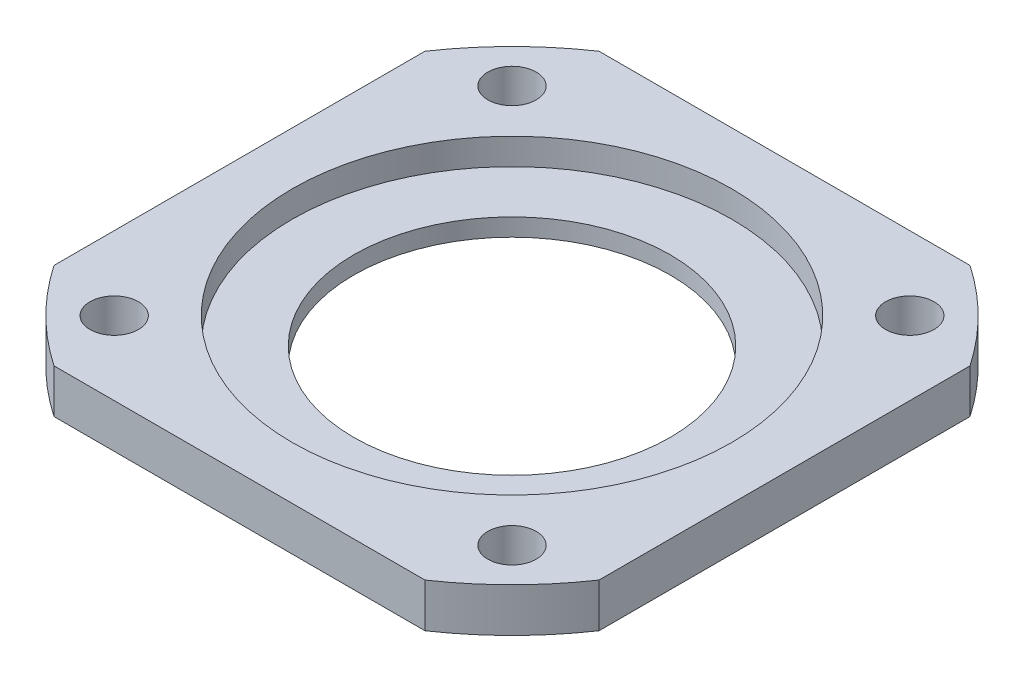
ISO-10303-21;
HEADER;
FILE_DESCRIPTION(('STEP AP214'),'2;1');
FILE_NAME('part.step','',(''),(''),'','','');
FILE_SCHEMA(('AUTOMOTIVE_DESIGN { 1 0 10303 214 1 1 1 1 }'));
ENDSEC;
DATA;
#1=APPLICATION_CONTEXT('core data for automotive mechanical design processes');
#2=APPLICATION_PROTOCOL_DEFINITION('international standard','automotive_design',2000,#1);
#3=PRODUCT_CONTEXT('',#1,'mechanical');
#4=PRODUCT('Part','Part','',(#3));
#5=PRODUCT_RELATED_PRODUCT_CATEGORY('part','',(#4));
#6=PRODUCT_DEFINITION_FORMATION('','',#4);
#7=PRODUCT_DEFINITION_CONTEXT('part definition',#1,'design');
#8=PRODUCT_DEFINITION('design','',#6,#7);
#9=PRODUCT_DEFINITION_SHAPE('','',#8);
#10=(LENGTH_UNIT() NAMED_UNIT(*) SI_UNIT(.MILLI.,.METRE.));
#11=(NAMED_UNIT(*) PLANE_ANGLE_UNIT() SI_UNIT($,.RADIAN.));
#12=(NAMED_UNIT(*) SI_UNIT($,.STERADIAN.) SOLID_ANGLE_UNIT());
#13=UNCERTAINTY_MEASURE_WITH_UNIT(LENGTH_MEASURE(1.E-05),#10,'distance_accuracy_value','');
#14=(GEOMETRIC_REPRESENTATION_CONTEXT(3) GLOBAL_UNCERTAINTY_ASSIGNED_CONTEXT((#13)) GLOBAL_UNIT_ASSIGNED_CONTEXT((#10,
#11,#12)) REPRESENTATION_CONTEXT('',''));
#15=CARTESIAN_POINT('',(0.,0.,0.));
#16=DIRECTION('',(0.,0.,1.));
#17=DIRECTION('',(1.,0.,0.));
#18=AXIS2_PLACEMENT_3D('',#15,#16,#17);
#19=CARTESIAN_POINT('',(0.,5.,0.));
#20=DIRECTION('',(0.,1.,0.));
#21=DIRECTION('',(0.,0.,1.));
#22=AXIS2_PLACEMENT_3D('',#19,#20,#21);
#23=PLANE('',#22);
#24=CARTESIAN_POINT('',(-22.6274169979695,5.,22.6274169979695));
#25=DIRECTION('',(0.,1.,0.));
#26=DIRECTION('',(0.,0.,1.));
#27=AXIS2_PLACEMENT_3D('',#24,#25,#26);
#28=CIRCLE('',#27,2.75);
#29=CARTESIAN_POINT('',(-22.6274169979695,5.,25.3774169979695));
#30=VERTEX_POINT('',#29);
#31=EDGE_CURVE('E202',#30,#30,#28,.T.);
#32=ORIENTED_EDGE('',*,*,#31,.F.);
#33=EDGE_LOOP('',(#32));
#34=FACE_BOUND('',#33,.T.);
#35=CARTESIAN_POINT('',(22.6274169979695,5.,22.6274169979695));
#36=DIRECTION('',(0.,1.,0.));
#37=DIRECTION('',(0.,0.,1.));
#38=AXIS2_PLACEMENT_3D('',#35,#36,#37);
#39=CIRCLE('',#38,2.75);
#40=CARTESIAN_POINT('',(22.6274169979695,5.,25.3774169979695));
#41=VERTEX_POINT('',#40);
#42=EDGE_CURVE('E208',#41,#41,#39,.T.);
#43=ORIENTED_EDGE('',*,*,#42,.F.);
#44=EDGE_LOOP('',(#43));
#45=FACE_BOUND('',#44,.T.);
#46=CARTESIAN_POINT('',(22.6274169979695,5.,-22.6274169979695));
#47=DIRECTION('',(0.,1.,0.));
#48=DIRECTION('',(0.,0.,1.));
#49=AXIS2_PLACEMENT_3D('',#46,#47,#48);
#50=CIRCLE('',#49,2.75);
#51=CARTESIAN_POINT('',(22.6274169979695,5.,-19.8774169979695));
#52=VERTEX_POINT('',#51);
#53=EDGE_CURVE('E214',#52,#52,#50,.T.);
#54=ORIENTED_EDGE('',*,*,#53,.F.);
#55=EDGE_LOOP('',(#54));
#56=FACE_BOUND('',#55,.T.);
#57=CARTESIAN_POINT('',(-22.6274169979695,5.,-22.6274169979695));
#58=DIRECTION('',(0.,1.,0.));
#59=DIRECTION('',(0.,0.,1.));
#60=AXIS2_PLACEMENT_3D('',#57,#58,#59);
#61=CIRCLE('',#60,2.75);
#62=CARTESIAN_POINT('',(-22.6274169979695,5.,-19.8774169979695));
#63=VERTEX_POINT('',#62);
#64=EDGE_CURVE('E196',#63,#63,#61,.T.);
#65=ORIENTED_EDGE('',*,*,#64,.F.);
#66=EDGE_LOOP('',(#65));
#67=FACE_BOUND('',#66,.T.);
#68=CARTESIAN_POINT('',(0.,5.,0.));
#69=DIRECTION('',(0.,1.,0.));
#70=DIRECTION('',(0.,0.,1.));
#71=AXIS2_PLACEMENT_3D('',#68,#69,#70);
#72=CIRCLE('',#71,25.);
#73=CARTESIAN_POINT('',(0.,5.,25.));
#74=VERTEX_POINT('',#73);
#75=EDGE_CURVE('E180',#74,#74,#72,.T.);
#76=ORIENTED_EDGE('',*,*,#75,.F.);
#77=EDGE_LOOP('',(#76));
#78=FACE_BOUND('',#77,.T.);
#79=CARTESIAN_POINT('',(0.,5.,0.));
#80=DIRECTION('',(0.,1.,0.));
#81=DIRECTION('',(0.,0.,1.));
#82=AXIS2_PLACEMENT_3D('',#79,#80,#81);
#83=CIRCLE('',#82,37.5);
#84=CARTESIAN_POINT('',(21.1009478460092,5.,31.));
#85=VERTEX_POINT('',#84);
#86=CARTESIAN_POINT('',(31.,5.,21.1009478460092));
#87=VERTEX_POINT('',#86);
#88=EDGE_CURVE('E121',#85,#87,#83,.T.);
#89=ORIENTED_EDGE('',*,*,#88,.T.);
#90=DIRECTION('',(0.,0.,-1.));
#91=VECTOR('',#90,1.);
#92=CARTESIAN_POINT('',(31.,5.,-31.));
#93=LINE('',#92,#91);
#94=CARTESIAN_POINT('',(31.,5.,-21.1009478460092));
#95=VERTEX_POINT('',#94);
#96=EDGE_CURVE('E107',#87,#95,#93,.T.);
#97=ORIENTED_EDGE('',*,*,#96,.T.);
#98=CARTESIAN_POINT('',(21.1009478460092,5.,-31.));
#99=VERTEX_POINT('',#98);
#100=EDGE_CURVE('E114',#95,#99,#83,.T.);
#101=ORIENTED_EDGE('',*,*,#100,.T.);
#102=DIRECTION('',(-1.,0.,0.));
#103=VECTOR('',#102,1.);
#104=CARTESIAN_POINT('',(-31.,5.,-31.));
#105=LINE('',#104,#103);
#106=CARTESIAN_POINT('',(-21.1009478460092,5.,-31.));
#107=VERTEX_POINT('',#106);
#108=EDGE_CURVE('E97',#99,#107,#105,.T.);
#109=ORIENTED_EDGE('',*,*,#108,.T.);
#110=CARTESIAN_POINT('',(-31.,5.,-21.1009478460092));
#111=VERTEX_POINT('',#110);
#112=EDGE_CURVE('E122',#107,#111,#83,.T.);
#113=ORIENTED_EDGE('',*,*,#112,.T.);
#114=DIRECTION('',(0.,0.,1.));
#115=VECTOR('',#114,1.);
#116=CARTESIAN_POINT('',(-31.,5.,-31.));
#117=LINE('',#116,#115);
#118=CARTESIAN_POINT('',(-31.,5.,21.1009478460092));
#119=VERTEX_POINT('',#118);
#120=EDGE_CURVE('E106',#111,#119,#117,.T.);
#121=ORIENTED_EDGE('',*,*,#120,.T.);
#122=CARTESIAN_POINT('',(-21.1009478460092,5.,31.));
#123=VERTEX_POINT('',#122);
#124=EDGE_CURVE('E124',#119,#123,#83,.T.);
#125=ORIENTED_EDGE('',*,*,#124,.T.);
#126=DIRECTION('',(1.,0.,0.));
#127=VECTOR('',#126,1.);
#128=CARTESIAN_POINT('',(-31.,5.,31.));
#129=LINE('',#128,#127);
#130=EDGE_CURVE('E185',#123,#85,#129,.T.);
#131=ORIENTED_EDGE('',*,*,#130,.T.);
#132=EDGE_LOOP('',(#89,#97,#101,#109,#113,#121,#125,#131));
#133=FACE_BOUND('',#132,.T.);
#134=ADVANCED_FACE('F35',(#34,#45,#56,#67,#78,#133),#23,.T.);
#135=CARTESIAN_POINT('',(0.,0.,0.));
#136=DIRECTION('',(0.,1.,0.));
#137=DIRECTION('',(0.,0.,1.));
#138=AXIS2_PLACEMENT_3D('',#135,#136,#137);
#139=PLANE('',#138);
#140=CARTESIAN_POINT('',(-22.6274169979695,0.,22.6274169979695));
#141=DIRECTION('',(0.,1.,0.));
#142=DIRECTION('',(0.,0.,1.));
#143=AXIS2_PLACEMENT_3D('',#140,#141,#142);
#144=CIRCLE('',#143,2.75);
#145=CARTESIAN_POINT('',(-22.6274169979695,0.,25.3774169979695));
#146=VERTEX_POINT('',#145);
#147=EDGE_CURVE('E205',#146,#146,#144,.T.);
#148=ORIENTED_EDGE('',*,*,#147,.T.);
#149=EDGE_LOOP('',(#148));
#150=FACE_BOUND('',#149,.T.);
#151=CARTESIAN_POINT('',(22.6274169979695,0.,22.6274169979695));
#152=DIRECTION('',(0.,1.,0.));
#153=DIRECTION('',(0.,0.,1.));
#154=AXIS2_PLACEMENT_3D('',#151,#152,#153);
#155=CIRCLE('',#154,2.75);
#156=CARTESIAN_POINT('',(22.6274169979695,0.,25.3774169979695));
#157=VERTEX_POINT('',#156);
#158=EDGE_CURVE('E211',#157,#157,#155,.T.);
#159=ORIENTED_EDGE('',*,*,#158,.T.);
#160=EDGE_LOOP('',(#159));
#161=FACE_BOUND('',#160,.T.);
#162=CARTESIAN_POINT('',(22.6274169979695,0.,-22.6274169979695));
#163=DIRECTION('',(0.,1.,0.));
#164=DIRECTION('',(0.,0.,1.));
#165=AXIS2_PLACEMENT_3D('',#162,#163,#164);
#166=CIRCLE('',#165,2.75);
#167=CARTESIAN_POINT('',(22.6274169979695,0.,-19.8774169979695));
#168=VERTEX_POINT('',#167);
#169=EDGE_CURVE('E199',#168,#168,#166,.T.);
#170=ORIENTED_EDGE('',*,*,#169,.T.);
#171=EDGE_LOOP('',(#170));
#172=FACE_BOUND('',#171,.T.);
#173=CARTESIAN_POINT('',(-22.6274169979695,0.,-22.6274169979695));
#174=DIRECTION('',(0.,1.,0.));
#175=DIRECTION('',(0.,0.,1.));
#176=AXIS2_PLACEMENT_3D('',#173,#174,#175);
#177=CIRCLE('',#176,2.75);
#178=CARTESIAN_POINT('',(-22.6274169979695,0.,-19.8774169979695));
#179=VERTEX_POINT('',#178);
#180=EDGE_CURVE('E191',#179,#179,#177,.T.);
#181=ORIENTED_EDGE('',*,*,#180,.T.);
#182=EDGE_LOOP('',(#181));
#183=FACE_BOUND('',#182,.T.);
#184=CARTESIAN_POINT('',(0.,0.,0.));
#185=DIRECTION('',(0.,1.,0.));
#186=DIRECTION('',(0.,0.,1.));
#187=AXIS2_PLACEMENT_3D('',#184,#185,#186);
#188=CIRCLE('',#187,18.);
#189=CARTESIAN_POINT('',(0.,0.,18.));
#190=VERTEX_POINT('',#189);
#191=EDGE_CURVE('E127',#190,#190,#188,.T.);
#192=ORIENTED_EDGE('',*,*,#191,.T.);
#193=EDGE_LOOP('',(#192));
#194=FACE_BOUND('',#193,.T.);
#195=DIRECTION('',(0.,0.,-1.));
#196=VECTOR('',#195,1.);
#197=CARTESIAN_POINT('',(31.,0.,-31.));
#198=LINE('',#197,#196);
#199=CARTESIAN_POINT('',(31.,0.,21.1009478460092));
#200=VERTEX_POINT('',#199);
#201=CARTESIAN_POINT('',(31.,0.,-21.1009478460092));
#202=VERTEX_POINT('',#201);
#203=EDGE_CURVE('E148',#200,#202,#198,.T.);
#204=ORIENTED_EDGE('',*,*,#203,.F.);
#205=CARTESIAN_POINT('',(0.,0.,0.));
#206=DIRECTION('',(0.,1.,0.));
#207=DIRECTION('',(0.,0.,1.));
#208=AXIS2_PLACEMENT_3D('',#205,#206,#207);
#209=CIRCLE('',#208,37.5);
#210=CARTESIAN_POINT('',(21.1009478460092,0.,31.));
#211=VERTEX_POINT('',#210);
#212=EDGE_CURVE('E129',#211,#200,#209,.T.);
#213=ORIENTED_EDGE('',*,*,#212,.F.);
#214=DIRECTION('',(1.,0.,0.));
#215=VECTOR('',#214,1.);
#216=CARTESIAN_POINT('',(-31.,0.,31.));
#217=LINE('',#216,#215);
#218=CARTESIAN_POINT('',(-21.1009478460092,0.,31.));
#219=VERTEX_POINT('',#218);
#220=EDGE_CURVE('E183',#219,#211,#217,.T.);
#221=ORIENTED_EDGE('',*,*,#220,.F.);
#222=CARTESIAN_POINT('',(-31.,0.,21.1009478460092));
#223=VERTEX_POINT('',#222);
#224=EDGE_CURVE('E132',#223,#219,#209,.T.);
#225=ORIENTED_EDGE('',*,*,#224,.F.);
#226=DIRECTION('',(0.,0.,1.));
#227=VECTOR('',#226,1.);
#228=CARTESIAN_POINT('',(-31.,0.,-31.));
#229=LINE('',#228,#227);
#230=CARTESIAN_POINT('',(-31.,0.,-21.1009478460092));
#231=VERTEX_POINT('',#230);
#232=EDGE_CURVE('E50',#231,#223,#229,.T.);
#233=ORIENTED_EDGE('',*,*,#232,.F.);
#234=CARTESIAN_POINT('',(-21.1009478460092,0.,-31.));
#235=VERTEX_POINT('',#234);
#236=EDGE_CURVE('E153',#235,#231,#209,.T.);
#237=ORIENTED_EDGE('',*,*,#236,.F.);
#238=DIRECTION('',(-1.,0.,0.));
#239=VECTOR('',#238,1.);
#240=CARTESIAN_POINT('',(-31.,0.,-31.));
#241=LINE('',#240,#239);
#242=CARTESIAN_POINT('',(21.1009478460092,0.,-31.));
#243=VERTEX_POINT('',#242);
#244=EDGE_CURVE('E58',#243,#235,#241,.T.);
#245=ORIENTED_EDGE('',*,*,#244,.F.);
#246=EDGE_CURVE('E116',#202,#243,#209,.T.);
#247=ORIENTED_EDGE('',*,*,#246,.F.);
#248=EDGE_LOOP('',(#204,#213,#221,#225,#233,#237,#245,#247));
#249=FACE_BOUND('',#248,.T.);
#250=ADVANCED_FACE('F150',(#150,#161,#172,#183,#194,#249),#139,.F.);
#251=CARTESIAN_POINT('',(0.,5.,0.));
#252=DIRECTION('',(0.,-1.,0.));
#253=DIRECTION('',(0.,0.,-1.));
#254=AXIS2_PLACEMENT_3D('',#251,#252,#253);
#255=CYLINDRICAL_SURFACE('',#254,37.5);
#256=DIRECTION('',(0.,-1.,0.));
#257=VECTOR('',#256,1.);
#258=CARTESIAN_POINT('',(31.,5.,21.1009478460092));
#259=LINE('',#258,#257);
#260=EDGE_CURVE('E12',#87,#200,#259,.T.);
#261=ORIENTED_EDGE('',*,*,#260,.F.);
#262=ORIENTED_EDGE('',*,*,#88,.F.);
#263=DIRECTION('',(0.,-1.,0.));
#264=VECTOR('',#263,1.);
#265=CARTESIAN_POINT('',(21.1009478460092,5.,31.));
#266=LINE('',#265,#264);
#267=EDGE_CURVE('E141',#211,#85,#266,.F.);
#268=ORIENTED_EDGE('',*,*,#267,.F.);
#269=ORIENTED_EDGE('',*,*,#212,.T.);
#270=EDGE_LOOP('',(#261,#262,#268,#269));
#271=FACE_BOUND('',#270,.T.);
#272=ADVANCED_FACE('F37',(#271),#255,.T.);
#273=DIRECTION('',(0.,-1.,0.));
#274=VECTOR('',#273,1.);
#275=CARTESIAN_POINT('',(31.,5.,-21.1009478460092));
#276=LINE('',#275,#274);
#277=EDGE_CURVE('E43',#202,#95,#276,.F.);
#278=ORIENTED_EDGE('',*,*,#277,.F.);
#279=ORIENTED_EDGE('',*,*,#246,.T.);
#280=DIRECTION('',(0.,-1.,0.));
#281=VECTOR('',#280,1.);
#282=CARTESIAN_POINT('',(21.1009478460092,5.,-31.));
#283=LINE('',#282,#281);
#284=EDGE_CURVE('E100',#99,#243,#283,.T.);
#285=ORIENTED_EDGE('',*,*,#284,.F.);
#286=ORIENTED_EDGE('',*,*,#100,.F.);
#287=EDGE_LOOP('',(#278,#279,#285,#286));
#288=FACE_BOUND('',#287,.T.);
#289=ADVANCED_FACE('F113',(#288),#255,.T.);
#290=DIRECTION('',(0.,-1.,0.));
#291=VECTOR('',#290,1.);
#292=CARTESIAN_POINT('',(-21.1009478460092,5.,31.));
#293=LINE('',#292,#291);
#294=EDGE_CURVE('E143',#123,#219,#293,.T.);
#295=ORIENTED_EDGE('',*,*,#294,.F.);
#296=ORIENTED_EDGE('',*,*,#124,.F.);
#297=DIRECTION('',(0.,-1.,0.));
#298=VECTOR('',#297,1.);
#299=CARTESIAN_POINT('',(-31.,5.,21.1009478460092));
#300=LINE('',#299,#298);
#301=EDGE_CURVE('E117',#223,#119,#300,.F.);
#302=ORIENTED_EDGE('',*,*,#301,.F.);
#303=ORIENTED_EDGE('',*,*,#224,.T.);
#304=EDGE_LOOP('',(#295,#296,#302,#303));
#305=FACE_BOUND('',#304,.T.);
#306=ADVANCED_FACE('F343',(#305),#255,.T.);
#307=DIRECTION('',(0.,-1.,0.));
#308=VECTOR('',#307,1.);
#309=CARTESIAN_POINT('',(-31.,5.,-21.1009478460092));
#310=LINE('',#309,#308);
#311=EDGE_CURVE('E139',#111,#231,#310,.T.);
#312=ORIENTED_EDGE('',*,*,#311,.F.);
#313=ORIENTED_EDGE('',*,*,#112,.F.);
#314=DIRECTION('',(0.,-1.,0.));
#315=VECTOR('',#314,1.);
#316=CARTESIAN_POINT('',(-21.1009478460092,5.,-31.));
#317=LINE('',#316,#315);
#318=EDGE_CURVE('E101',#235,#107,#317,.F.);
#319=ORIENTED_EDGE('',*,*,#318,.F.);
#320=ORIENTED_EDGE('',*,*,#236,.T.);
#321=EDGE_LOOP('',(#312,#313,#319,#320));
#322=FACE_BOUND('',#321,.T.);
#323=ADVANCED_FACE('F169',(#322),#255,.T.);
#324=CARTESIAN_POINT('',(0.,5.,0.));
#325=DIRECTION('',(0.,-1.,0.));
#326=DIRECTION('',(0.,0.,-1.));
#327=AXIS2_PLACEMENT_3D('',#324,#325,#326);
#328=CYLINDRICAL_SURFACE('',#327,18.);
#329=ORIENTED_EDGE('',*,*,#191,.F.);
#330=EDGE_LOOP('',(#329));
#331=FACE_BOUND('',#330,.T.);
#332=CARTESIAN_POINT('',(0.,2.,0.));
#333=DIRECTION('',(0.,1.,0.));
#334=DIRECTION('',(0.,0.,1.));
#335=AXIS2_PLACEMENT_3D('',#332,#333,#334);
#336=CIRCLE('',#335,18.);
#337=CARTESIAN_POINT('',(0.,2.,18.));
#338=VERTEX_POINT('',#337);
#339=EDGE_CURVE('E133',#338,#338,#336,.T.);
#340=ORIENTED_EDGE('',*,*,#339,.T.);
#341=EDGE_LOOP('',(#340));
#342=FACE_BOUND('',#341,.T.);
#343=ADVANCED_FACE('F165',(#331,#342),#328,.F.);
#344=CARTESIAN_POINT('',(0.,2.,0.));
#345=DIRECTION('',(0.,1.,0.));
#346=DIRECTION('',(0.,0.,1.));
#347=AXIS2_PLACEMENT_3D('',#344,#345,#346);
#348=CYLINDRICAL_SURFACE('',#347,25.);
#349=CARTESIAN_POINT('',(0.,2.,0.));
#350=DIRECTION('',(0.,1.,0.));
#351=DIRECTION('',(0.,0.,1.));
#352=AXIS2_PLACEMENT_3D('',#349,#350,#351);
#353=CIRCLE('',#352,25.);
#354=CARTESIAN_POINT('',(0.,2.,25.));
#355=VERTEX_POINT('',#354);
#356=EDGE_CURVE('E136',#355,#355,#353,.T.);
#357=ORIENTED_EDGE('',*,*,#356,.F.);
#358=EDGE_LOOP('',(#357));
#359=FACE_BOUND('',#358,.T.);
#360=ORIENTED_EDGE('',*,*,#75,.T.);
#361=EDGE_LOOP('',(#360));
#362=FACE_BOUND('',#361,.T.);
#363=ADVANCED_FACE('F168',(#359,#362),#348,.F.);
#364=CARTESIAN_POINT('',(0.,2.,0.));
#365=DIRECTION('',(0.,1.,0.));
#366=DIRECTION('',(0.,0.,1.));
#367=AXIS2_PLACEMENT_3D('',#364,#365,#366);
#368=PLANE('',#367);
#369=ORIENTED_EDGE('',*,*,#339,.F.);
#370=EDGE_LOOP('',(#369));
#371=FACE_BOUND('',#370,.T.);
#372=ORIENTED_EDGE('',*,*,#356,.T.);
#373=EDGE_LOOP('',(#372));
#374=FACE_BOUND('',#373,.T.);
#375=ADVANCED_FACE('F173',(#371,#374),#368,.T.);
#376=CARTESIAN_POINT('',(-31.,0.,-31.));
#377=DIRECTION('',(0.,0.,-1.));
#378=DIRECTION('',(-1.,0.,0.));
#379=AXIS2_PLACEMENT_3D('',#376,#377,#378);
#380=PLANE('',#379);
#381=ORIENTED_EDGE('',*,*,#284,.T.);
#382=ORIENTED_EDGE('',*,*,#244,.T.);
#383=ORIENTED_EDGE('',*,*,#318,.T.);
#384=ORIENTED_EDGE('',*,*,#108,.F.);
#385=EDGE_LOOP('',(#381,#382,#383,#384));
#386=FACE_BOUND('',#385,.T.);
#387=ADVANCED_FACE('F99',(#386),#380,.T.);
#388=CARTESIAN_POINT('',(-31.,0.,-31.));
#389=DIRECTION('',(-1.,0.,0.));
#390=DIRECTION('',(0.,0.,1.));
#391=AXIS2_PLACEMENT_3D('',#388,#389,#390);
#392=PLANE('',#391);
#393=ORIENTED_EDGE('',*,*,#311,.T.);
#394=ORIENTED_EDGE('',*,*,#232,.T.);
#395=ORIENTED_EDGE('',*,*,#301,.T.);
#396=ORIENTED_EDGE('',*,*,#120,.F.);
#397=EDGE_LOOP('',(#393,#394,#395,#396));
#398=FACE_BOUND('',#397,.T.);
#399=ADVANCED_FACE('F271',(#398),#392,.T.);
#400=CARTESIAN_POINT('',(-31.,0.,31.));
#401=DIRECTION('',(0.,0.,1.));
#402=DIRECTION('',(1.,0.,0.));
#403=AXIS2_PLACEMENT_3D('',#400,#401,#402);
#404=PLANE('',#403);
#405=ORIENTED_EDGE('',*,*,#294,.T.);
#406=ORIENTED_EDGE('',*,*,#220,.T.);
#407=ORIENTED_EDGE('',*,*,#267,.T.);
#408=ORIENTED_EDGE('',*,*,#130,.F.);
#409=EDGE_LOOP('',(#405,#406,#407,#408));
#410=FACE_BOUND('',#409,.T.);
#411=ADVANCED_FACE('F268',(#410),#404,.T.);
#412=CARTESIAN_POINT('',(31.,0.,-31.));
#413=DIRECTION('',(1.,0.,0.));
#414=DIRECTION('',(0.,0.,-1.));
#415=AXIS2_PLACEMENT_3D('',#412,#413,#414);
#416=PLANE('',#415);
#417=ORIENTED_EDGE('',*,*,#260,.T.);
#418=ORIENTED_EDGE('',*,*,#203,.T.);
#419=ORIENTED_EDGE('',*,*,#277,.T.);
#420=ORIENTED_EDGE('',*,*,#96,.F.);
#421=EDGE_LOOP('',(#417,#418,#419,#420));
#422=FACE_BOUND('',#421,.T.);
#423=ADVANCED_FACE('F145',(#422),#416,.T.);
#424=CARTESIAN_POINT('',(-22.6274169979695,0.,-22.6274169979695));
#425=DIRECTION('',(0.,1.,0.));
#426=DIRECTION('',(0.,0.,1.));
#427=AXIS2_PLACEMENT_3D('',#424,#425,#426);
#428=CYLINDRICAL_SURFACE('',#427,2.75);
#429=ORIENTED_EDGE('',*,*,#180,.F.);
#430=EDGE_LOOP('',(#429));
#431=FACE_BOUND('',#430,.T.);
#432=ORIENTED_EDGE('',*,*,#64,.T.);
#433=EDGE_LOOP('',(#432));
#434=FACE_BOUND('',#433,.T.);
#435=ADVANCED_FACE('F226',(#431,#434),#428,.F.);
#436=CARTESIAN_POINT('',(22.6274169979695,0.,-22.6274169979695));
#437=DIRECTION('',(0.,1.,0.));
#438=DIRECTION('',(0.,0.,1.));
#439=AXIS2_PLACEMENT_3D('',#436,#437,#438);
#440=CYLINDRICAL_SURFACE('',#439,2.75);
#441=ORIENTED_EDGE('',*,*,#169,.F.);
#442=EDGE_LOOP('',(#441));
#443=FACE_BOUND('',#442,.T.);
#444=ORIENTED_EDGE('',*,*,#53,.T.);
#445=EDGE_LOOP('',(#444));
#446=FACE_BOUND('',#445,.T.);
#447=ADVANCED_FACE('F222',(#443,#446),#440,.F.);
#448=CARTESIAN_POINT('',(22.6274169979695,0.,22.6274169979695));
#449=DIRECTION('',(0.,1.,0.));
#450=DIRECTION('',(0.,0.,1.));
#451=AXIS2_PLACEMENT_3D('',#448,#449,#450);
#452=CYLINDRICAL_SURFACE('',#451,2.75);
#453=ORIENTED_EDGE('',*,*,#158,.F.);
#454=EDGE_LOOP('',(#453));
#455=FACE_BOUND('',#454,.T.);
#456=ORIENTED_EDGE('',*,*,#42,.T.);
#457=EDGE_LOOP('',(#456));
#458=FACE_BOUND('',#457,.T.);
#459=ADVANCED_FACE('F225',(#455,#458),#452,.F.);
#460=CARTESIAN_POINT('',(-22.6274169979695,0.,22.6274169979695));
#461=DIRECTION('',(0.,1.,0.));
#462=DIRECTION('',(0.,0.,1.));
#463=AXIS2_PLACEMENT_3D('',#460,#461,#462);
#464=CYLINDRICAL_SURFACE('',#463,2.75);
#465=ORIENTED_EDGE('',*,*,#147,.F.);
#466=EDGE_LOOP('',(#465));
#467=FACE_BOUND('',#466,.T.);
#468=ORIENTED_EDGE('',*,*,#31,.T.);
#469=EDGE_LOOP('',(#468));
#470=FACE_BOUND('',#469,.T.);
#471=ADVANCED_FACE('F255',(#467,#470),#464,.F.);
#472=CLOSED_SHELL('',(#134,#250,#272,#289,#306,#323,#343,#363,#375,#387,#399,#411,#423,#435,
#447,#459,#471));
#473=MANIFOLD_SOLID_BREP('B2',#472);
#474=ADVANCED_BREP_SHAPE_REPRESENTATION('',(#18,#473),#14);
#475=SHAPE_DEFINITION_REPRESENTATION(#9,#474);
ENDSEC;
END-ISO-10303-21;
